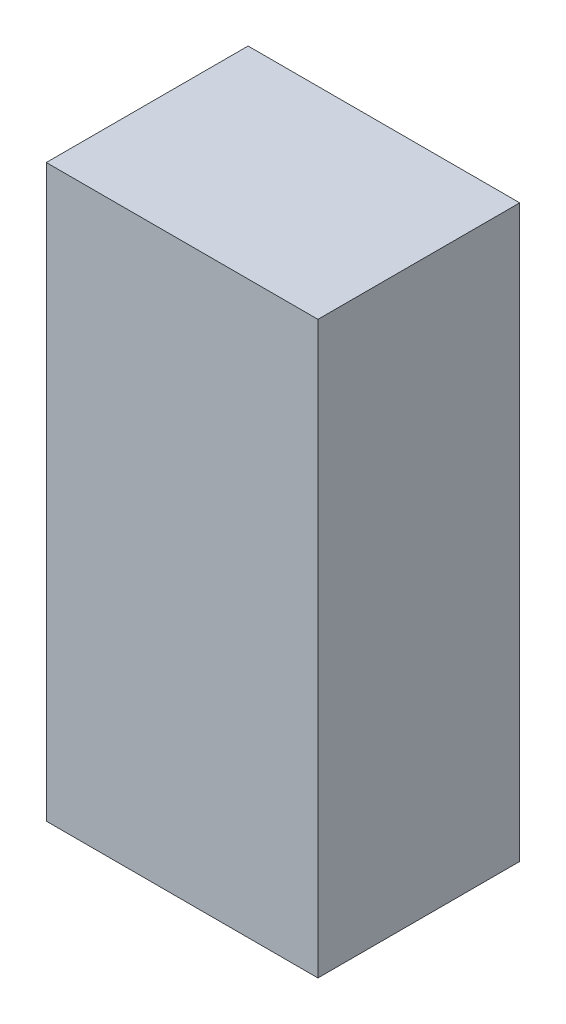
ISO-10303-21;
HEADER;
FILE_DESCRIPTION(('STEP AP214'),'2;1');
FILE_NAME('part.step','',(''),(''),'','','');
FILE_SCHEMA(('AUTOMOTIVE_DESIGN { 1 0 10303 214 1 1 1 1 }'));
ENDSEC;
DATA;
#1=APPLICATION_CONTEXT('core data for automotive mechanical design processes');
#2=APPLICATION_PROTOCOL_DEFINITION('international standard','automotive_design',2000,#1);
#3=PRODUCT_CONTEXT('',#1,'mechanical');
#4=PRODUCT('Part','Part','',(#3));
#5=PRODUCT_RELATED_PRODUCT_CATEGORY('part','',(#4));
#6=PRODUCT_DEFINITION_FORMATION('','',#4);
#7=PRODUCT_DEFINITION_CONTEXT('part definition',#1,'design');
#8=PRODUCT_DEFINITION('design','',#6,#7);
#9=PRODUCT_DEFINITION_SHAPE('','',#8);
#10=(LENGTH_UNIT() NAMED_UNIT(*) SI_UNIT(.MILLI.,.METRE.));
#11=(NAMED_UNIT(*) PLANE_ANGLE_UNIT() SI_UNIT($,.RADIAN.));
#12=(NAMED_UNIT(*) SI_UNIT($,.STERADIAN.) SOLID_ANGLE_UNIT());
#13=UNCERTAINTY_MEASURE_WITH_UNIT(LENGTH_MEASURE(1.E-05),#10,'distance_accuracy_value','');
#14=(GEOMETRIC_REPRESENTATION_CONTEXT(3) GLOBAL_UNCERTAINTY_ASSIGNED_CONTEXT((#13)) GLOBAL_UNIT_ASSIGNED_CONTEXT((#10,
#11,#12)) REPRESENTATION_CONTEXT('',''));
#15=CARTESIAN_POINT('',(0.,0.,0.));
#16=DIRECTION('',(0.,0.,1.));
#17=DIRECTION('',(1.,0.,0.));
#18=AXIS2_PLACEMENT_3D('',#15,#16,#17);
#19=CARTESIAN_POINT('',(17.5,73.5,13.));
#20=DIRECTION('',(-1.,0.,0.));
#21=DIRECTION('',(0.,0.,1.));
#22=AXIS2_PLACEMENT_3D('',#19,#20,#21);
#23=PLANE('',#22);
#24=DIRECTION('',(0.,0.,-1.));
#25=VECTOR('',#24,1.);
#26=CARTESIAN_POINT('',(17.5,0.,13.));
#27=LINE('',#26,#25);
#28=CARTESIAN_POINT('',(17.5,0.,13.));
#29=VERTEX_POINT('',#28);
#30=CARTESIAN_POINT('',(17.5,0.,-13.));
#31=VERTEX_POINT('',#30);
#32=EDGE_CURVE('E96',#29,#31,#27,.T.);
#33=ORIENTED_EDGE('',*,*,#32,.T.);
#34=DIRECTION('',(0.,-1.,0.));
#35=VECTOR('',#34,1.);
#36=CARTESIAN_POINT('',(17.5,73.5,-13.));
#37=LINE('',#36,#35);
#38=CARTESIAN_POINT('',(17.5,73.5,-13.));
#39=VERTEX_POINT('',#38);
#40=EDGE_CURVE('E11',#39,#31,#37,.T.);
#41=ORIENTED_EDGE('',*,*,#40,.F.);
#42=DIRECTION('',(0.,0.,-1.));
#43=VECTOR('',#42,1.);
#44=CARTESIAN_POINT('',(17.5,73.5,13.));
#45=LINE('',#44,#43);
#46=CARTESIAN_POINT('',(17.5,73.5,13.));
#47=VERTEX_POINT('',#46);
#48=EDGE_CURVE('E84',#47,#39,#45,.T.);
#49=ORIENTED_EDGE('',*,*,#48,.F.);
#50=DIRECTION('',(0.,-1.,0.));
#51=VECTOR('',#50,1.);
#52=CARTESIAN_POINT('',(17.5,73.5,13.));
#53=LINE('',#52,#51);
#54=EDGE_CURVE('E92',#47,#29,#53,.T.);
#55=ORIENTED_EDGE('',*,*,#54,.T.);
#56=EDGE_LOOP('',(#33,#41,#49,#55));
#57=FACE_BOUND('',#56,.T.);
#58=ADVANCED_FACE('F33',(#57),#23,.F.);
#59=CARTESIAN_POINT('',(-17.5,73.5,-13.));
#60=DIRECTION('',(0.,0.,1.));
#61=DIRECTION('',(1.,0.,0.));
#62=AXIS2_PLACEMENT_3D('',#59,#60,#61);
#63=PLANE('',#62);
#64=DIRECTION('',(-1.,0.,0.));
#65=VECTOR('',#64,1.);
#66=CARTESIAN_POINT('',(-17.5,0.,-13.));
#67=LINE('',#66,#65);
#68=CARTESIAN_POINT('',(-17.5,0.,-13.));
#69=VERTEX_POINT('',#68);
#70=EDGE_CURVE('E88',#31,#69,#67,.T.);
#71=ORIENTED_EDGE('',*,*,#70,.T.);
#72=DIRECTION('',(0.,-1.,0.));
#73=VECTOR('',#72,1.);
#74=CARTESIAN_POINT('',(-17.5,73.5,-13.));
#75=LINE('',#74,#73);
#76=CARTESIAN_POINT('',(-17.5,73.5,-13.));
#77=VERTEX_POINT('',#76);
#78=EDGE_CURVE('E41',#77,#69,#75,.T.);
#79=ORIENTED_EDGE('',*,*,#78,.F.);
#80=DIRECTION('',(-1.,0.,0.));
#81=VECTOR('',#80,1.);
#82=CARTESIAN_POINT('',(-17.5,73.5,-13.));
#83=LINE('',#82,#81);
#84=EDGE_CURVE('E79',#39,#77,#83,.T.);
#85=ORIENTED_EDGE('',*,*,#84,.F.);
#86=ORIENTED_EDGE('',*,*,#40,.T.);
#87=EDGE_LOOP('',(#71,#79,#85,#86));
#88=FACE_BOUND('',#87,.T.);
#89=ADVANCED_FACE('F87',(#88),#63,.F.);
#90=CARTESIAN_POINT('',(-17.5,73.5,13.));
#91=DIRECTION('',(1.,0.,0.));
#92=DIRECTION('',(0.,0.,-1.));
#93=AXIS2_PLACEMENT_3D('',#90,#91,#92);
#94=PLANE('',#93);
#95=DIRECTION('',(0.,0.,1.));
#96=VECTOR('',#95,1.);
#97=CARTESIAN_POINT('',(-17.5,0.,13.));
#98=LINE('',#97,#96);
#99=CARTESIAN_POINT('',(-17.5,0.,13.));
#100=VERTEX_POINT('',#99);
#101=EDGE_CURVE('E66',#69,#100,#98,.T.);
#102=ORIENTED_EDGE('',*,*,#101,.T.);
#103=DIRECTION('',(0.,-1.,0.));
#104=VECTOR('',#103,1.);
#105=CARTESIAN_POINT('',(-17.5,73.5,13.));
#106=LINE('',#105,#104);
#107=CARTESIAN_POINT('',(-17.5,73.5,13.));
#108=VERTEX_POINT('',#107);
#109=EDGE_CURVE('E89',#108,#100,#106,.T.);
#110=ORIENTED_EDGE('',*,*,#109,.F.);
#111=DIRECTION('',(0.,0.,1.));
#112=VECTOR('',#111,1.);
#113=CARTESIAN_POINT('',(-17.5,73.5,13.));
#114=LINE('',#113,#112);
#115=EDGE_CURVE('E82',#77,#108,#114,.T.);
#116=ORIENTED_EDGE('',*,*,#115,.F.);
#117=ORIENTED_EDGE('',*,*,#78,.T.);
#118=EDGE_LOOP('',(#102,#110,#116,#117));
#119=FACE_BOUND('',#118,.T.);
#120=ADVANCED_FACE('F90',(#119),#94,.F.);
#121=CARTESIAN_POINT('',(-17.5,73.5,13.));
#122=DIRECTION('',(0.,0.,-1.));
#123=DIRECTION('',(-1.,0.,0.));
#124=AXIS2_PLACEMENT_3D('',#121,#122,#123);
#125=PLANE('',#124);
#126=DIRECTION('',(1.,0.,0.));
#127=VECTOR('',#126,1.);
#128=CARTESIAN_POINT('',(-17.5,0.,13.));
#129=LINE('',#128,#127);
#130=EDGE_CURVE('E72',#100,#29,#129,.T.);
#131=ORIENTED_EDGE('',*,*,#130,.T.);
#132=ORIENTED_EDGE('',*,*,#54,.F.);
#133=DIRECTION('',(1.,0.,0.));
#134=VECTOR('',#133,1.);
#135=CARTESIAN_POINT('',(-17.5,73.5,13.));
#136=LINE('',#135,#134);
#137=EDGE_CURVE('E49',#108,#47,#136,.T.);
#138=ORIENTED_EDGE('',*,*,#137,.F.);
#139=ORIENTED_EDGE('',*,*,#109,.T.);
#140=EDGE_LOOP('',(#131,#132,#138,#139));
#141=FACE_BOUND('',#140,.T.);
#142=ADVANCED_FACE('F103',(#141),#125,.F.);
#143=CARTESIAN_POINT('',(0.,73.5,0.));
#144=DIRECTION('',(0.,-1.,0.));
#145=DIRECTION('',(0.,0.,-1.));
#146=AXIS2_PLACEMENT_3D('',#143,#144,#145);
#147=PLANE('',#146);
#148=ORIENTED_EDGE('',*,*,#48,.T.);
#149=ORIENTED_EDGE('',*,*,#84,.T.);
#150=ORIENTED_EDGE('',*,*,#115,.T.);
#151=ORIENTED_EDGE('',*,*,#137,.T.);
#152=EDGE_LOOP('',(#148,#149,#150,#151));
#153=FACE_BOUND('',#152,.T.);
#154=ADVANCED_FACE('F80',(#153),#147,.F.);
#155=CARTESIAN_POINT('',(0.,0.,0.));
#156=DIRECTION('',(0.,-1.,0.));
#157=DIRECTION('',(0.,0.,-1.));
#158=AXIS2_PLACEMENT_3D('',#155,#156,#157);
#159=PLANE('',#158);
#160=ORIENTED_EDGE('',*,*,#32,.F.);
#161=ORIENTED_EDGE('',*,*,#130,.F.);
#162=ORIENTED_EDGE('',*,*,#101,.F.);
#163=ORIENTED_EDGE('',*,*,#70,.F.);
#164=EDGE_LOOP('',(#160,#161,#162,#163));
#165=FACE_BOUND('',#164,.T.);
#166=ADVANCED_FACE('F106',(#165),#159,.T.);
#167=CLOSED_SHELL('',(#58,#89,#120,#142,#154,#166));
#168=MANIFOLD_SOLID_BREP('B2',#167);
#169=ADVANCED_BREP_SHAPE_REPRESENTATION('',(#18,#168),#14);
#170=SHAPE_DEFINITION_REPRESENTATION(#9,#169);
ENDSEC;
END-ISO-10303-21;
